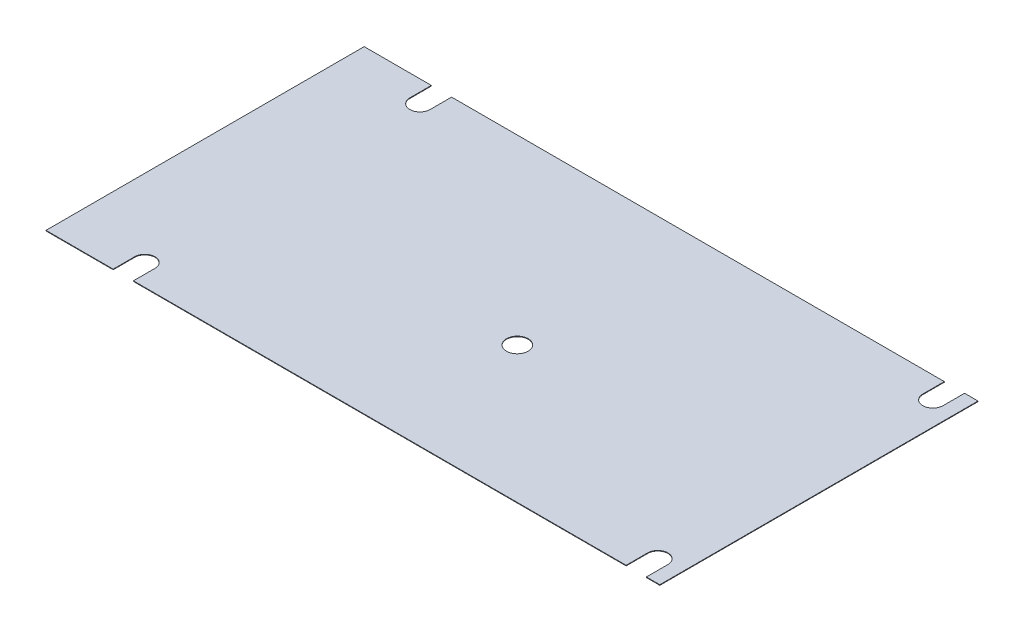
ISO-10303-21;
HEADER;
FILE_DESCRIPTION(('STEP AP214'),'2;1');
FILE_NAME('part.step','',(''),(''),'','','');
FILE_SCHEMA(('AUTOMOTIVE_DESIGN { 1 0 10303 214 1 1 1 1 }'));
ENDSEC;
DATA;
#1=APPLICATION_CONTEXT('core data for automotive mechanical design processes');
#2=APPLICATION_PROTOCOL_DEFINITION('international standard','automotive_design',2000,#1);
#3=PRODUCT_CONTEXT('',#1,'mechanical');
#4=PRODUCT('Part','Part','',(#3));
#5=PRODUCT_RELATED_PRODUCT_CATEGORY('part','',(#4));
#6=PRODUCT_DEFINITION_FORMATION('','',#4);
#7=PRODUCT_DEFINITION_CONTEXT('part definition',#1,'design');
#8=PRODUCT_DEFINITION('design','',#6,#7);
#9=PRODUCT_DEFINITION_SHAPE('','',#8);
#10=(LENGTH_UNIT() NAMED_UNIT(*) SI_UNIT(.MILLI.,.METRE.));
#11=(NAMED_UNIT(*) PLANE_ANGLE_UNIT() SI_UNIT($,.RADIAN.));
#12=(NAMED_UNIT(*) SI_UNIT($,.STERADIAN.) SOLID_ANGLE_UNIT());
#13=UNCERTAINTY_MEASURE_WITH_UNIT(LENGTH_MEASURE(1.E-05),#10,'distance_accuracy_value','');
#14=(GEOMETRIC_REPRESENTATION_CONTEXT(3) GLOBAL_UNCERTAINTY_ASSIGNED_CONTEXT((#13)) GLOBAL_UNIT_ASSIGNED_CONTEXT((#10,
#11,#12)) REPRESENTATION_CONTEXT('',''));
#15=CARTESIAN_POINT('',(0.,0.,0.));
#16=DIRECTION('',(0.,0.,1.));
#17=DIRECTION('',(1.,0.,0.));
#18=AXIS2_PLACEMENT_3D('',#15,#16,#17);
#19=CARTESIAN_POINT('',(-106.2,1.2,-55.05));
#20=DIRECTION('',(0.,0.,1.));
#21=DIRECTION('',(1.,0.,0.));
#22=AXIS2_PLACEMENT_3D('',#19,#20,#21);
#23=PLANE('',#22);
#24=DIRECTION('',(-1.,0.,0.));
#25=VECTOR('',#24,1.);
#26=CARTESIAN_POINT('',(-106.2,1.2,-55.05));
#27=LINE('',#26,#25);
#28=CARTESIAN_POINT('',(94.5500000000001,1.2,-55.0500000000001));
#29=VERTEX_POINT('',#28);
#30=CARTESIAN_POINT('',(-75.9499999999999,1.2,-55.05));
#31=VERTEX_POINT('',#30);
#32=EDGE_CURVE('E294',#29,#31,#27,.T.);
#33=ORIENTED_EDGE('',*,*,#32,.F.);
#34=DIRECTION('',(0.,-1.,0.));
#35=VECTOR('',#34,1.);
#36=CARTESIAN_POINT('',(94.5500000000001,1.2,-55.0500000000001));
#37=LINE('',#36,#35);
#38=CARTESIAN_POINT('',(94.5500000000001,1.,-55.0500000000001));
#39=VERTEX_POINT('',#38);
#40=EDGE_CURVE('E322',#29,#39,#37,.T.);
#41=ORIENTED_EDGE('',*,*,#40,.T.);
#42=DIRECTION('',(-1.,0.,0.));
#43=VECTOR('',#42,1.);
#44=CARTESIAN_POINT('',(-106.2,1.,-55.05));
#45=LINE('',#44,#43);
#46=CARTESIAN_POINT('',(-75.9499999999999,1.,-55.05));
#47=VERTEX_POINT('',#46);
#48=EDGE_CURVE('E275',#39,#47,#45,.T.);
#49=ORIENTED_EDGE('',*,*,#48,.T.);
#50=DIRECTION('',(0.,1.,0.));
#51=VECTOR('',#50,1.);
#52=CARTESIAN_POINT('',(-75.9499999999999,1.2,-55.05));
#53=LINE('',#52,#51);
#54=EDGE_CURVE('E180',#47,#31,#53,.T.);
#55=ORIENTED_EDGE('',*,*,#54,.T.);
#56=EDGE_LOOP('',(#33,#41,#49,#55));
#57=FACE_BOUND('',#56,.T.);
#58=ADVANCED_FACE('F38',(#57),#23,.F.);
#59=CARTESIAN_POINT('',(-82.9499999999999,1.2,-55.05));
#60=VERTEX_POINT('',#59);
#61=CARTESIAN_POINT('',(-106.2,1.2,-55.05));
#62=VERTEX_POINT('',#61);
#63=EDGE_CURVE('E251',#60,#62,#27,.T.);
#64=ORIENTED_EDGE('',*,*,#63,.F.);
#65=DIRECTION('',(0.,-1.,0.));
#66=VECTOR('',#65,1.);
#67=CARTESIAN_POINT('',(-82.9499999999999,1.2,-55.05));
#68=LINE('',#67,#66);
#69=CARTESIAN_POINT('',(-82.9499999999999,1.,-55.0500000000001));
#70=VERTEX_POINT('',#69);
#71=EDGE_CURVE('E274',#60,#70,#68,.T.);
#72=ORIENTED_EDGE('',*,*,#71,.T.);
#73=CARTESIAN_POINT('',(-106.2,1.,-55.05));
#74=VERTEX_POINT('',#73);
#75=EDGE_CURVE('E273',#70,#74,#45,.T.);
#76=ORIENTED_EDGE('',*,*,#75,.T.);
#77=DIRECTION('',(0.,-1.,0.));
#78=VECTOR('',#77,1.);
#79=CARTESIAN_POINT('',(-106.2,1.2,-55.05));
#80=LINE('',#79,#78);
#81=EDGE_CURVE('E186',#62,#74,#80,.T.);
#82=ORIENTED_EDGE('',*,*,#81,.F.);
#83=EDGE_LOOP('',(#64,#72,#76,#82));
#84=FACE_BOUND('',#83,.T.);
#85=ADVANCED_FACE('F271',(#84),#23,.F.);
#86=CARTESIAN_POINT('',(106.2,1.2,55.05));
#87=DIRECTION('',(0.,0.,-1.));
#88=DIRECTION('',(-1.,0.,0.));
#89=AXIS2_PLACEMENT_3D('',#86,#87,#88);
#90=PLANE('',#89);
#91=DIRECTION('',(1.,0.,0.));
#92=VECTOR('',#91,1.);
#93=CARTESIAN_POINT('',(106.2,1.2,55.05));
#94=LINE('',#93,#92);
#95=CARTESIAN_POINT('',(-75.9499999999999,1.2,55.05));
#96=VERTEX_POINT('',#95);
#97=CARTESIAN_POINT('',(94.5500000000001,1.2,55.05));
#98=VERTEX_POINT('',#97);
#99=EDGE_CURVE('E288',#96,#98,#94,.T.);
#100=ORIENTED_EDGE('',*,*,#99,.F.);
#101=DIRECTION('',(0.,-1.,0.));
#102=VECTOR('',#101,1.);
#103=CARTESIAN_POINT('',(-75.9499999999999,1.2,55.05));
#104=LINE('',#103,#102);
#105=CARTESIAN_POINT('',(-75.9499999999999,1.,55.05));
#106=VERTEX_POINT('',#105);
#107=EDGE_CURVE('E297',#96,#106,#104,.T.);
#108=ORIENTED_EDGE('',*,*,#107,.T.);
#109=DIRECTION('',(1.,0.,0.));
#110=VECTOR('',#109,1.);
#111=CARTESIAN_POINT('',(106.2,1.,55.05));
#112=LINE('',#111,#110);
#113=CARTESIAN_POINT('',(94.5500000000001,1.,55.05));
#114=VERTEX_POINT('',#113);
#115=EDGE_CURVE('E238',#106,#114,#112,.T.);
#116=ORIENTED_EDGE('',*,*,#115,.T.);
#117=DIRECTION('',(0.,1.,0.));
#118=VECTOR('',#117,1.);
#119=CARTESIAN_POINT('',(94.5500000000001,1.2,55.05));
#120=LINE('',#119,#118);
#121=EDGE_CURVE('E53',#114,#98,#120,.T.);
#122=ORIENTED_EDGE('',*,*,#121,.T.);
#123=EDGE_LOOP('',(#100,#108,#116,#122));
#124=FACE_BOUND('',#123,.T.);
#125=ADVANCED_FACE('F407',(#124),#90,.F.);
#126=CARTESIAN_POINT('',(101.55,1.2,55.05));
#127=VERTEX_POINT('',#126);
#128=CARTESIAN_POINT('',(106.2,1.2,55.05));
#129=VERTEX_POINT('',#128);
#130=EDGE_CURVE('E289',#127,#129,#94,.T.);
#131=ORIENTED_EDGE('',*,*,#130,.F.);
#132=DIRECTION('',(0.,-1.,0.));
#133=VECTOR('',#132,1.);
#134=CARTESIAN_POINT('',(101.55,1.2,55.05));
#135=LINE('',#134,#133);
#136=CARTESIAN_POINT('',(101.55,1.,55.05));
#137=VERTEX_POINT('',#136);
#138=EDGE_CURVE('E309',#127,#137,#135,.T.);
#139=ORIENTED_EDGE('',*,*,#138,.T.);
#140=CARTESIAN_POINT('',(106.2,1.,55.05));
#141=VERTEX_POINT('',#140);
#142=EDGE_CURVE('E242',#137,#141,#112,.T.);
#143=ORIENTED_EDGE('',*,*,#142,.T.);
#144=DIRECTION('',(0.,-1.,0.));
#145=VECTOR('',#144,1.);
#146=CARTESIAN_POINT('',(106.2,1.2,55.05));
#147=LINE('',#146,#145);
#148=EDGE_CURVE('E255',#129,#141,#147,.T.);
#149=ORIENTED_EDGE('',*,*,#148,.F.);
#150=EDGE_LOOP('',(#131,#139,#143,#149));
#151=FACE_BOUND('',#150,.T.);
#152=ADVANCED_FACE('F399',(#151),#90,.F.);
#153=CARTESIAN_POINT('',(106.2,1.,-55.0500000000001));
#154=VERTEX_POINT('',#153);
#155=CARTESIAN_POINT('',(101.55,1.,-55.0500000000001));
#156=VERTEX_POINT('',#155);
#157=EDGE_CURVE('E277',#154,#156,#45,.T.);
#158=ORIENTED_EDGE('',*,*,#157,.T.);
#159=DIRECTION('',(0.,1.,0.));
#160=VECTOR('',#159,1.);
#161=CARTESIAN_POINT('',(101.55,1.2,-55.0500000000001));
#162=LINE('',#161,#160);
#163=CARTESIAN_POINT('',(101.55,1.2,-55.0500000000001));
#164=VERTEX_POINT('',#163);
#165=EDGE_CURVE('E328',#156,#164,#162,.T.);
#166=ORIENTED_EDGE('',*,*,#165,.T.);
#167=CARTESIAN_POINT('',(106.2,1.2,-55.0500000000001));
#168=VERTEX_POINT('',#167);
#169=EDGE_CURVE('E291',#168,#164,#27,.T.);
#170=ORIENTED_EDGE('',*,*,#169,.F.);
#171=DIRECTION('',(0.,-1.,0.));
#172=VECTOR('',#171,1.);
#173=CARTESIAN_POINT('',(106.2,1.2,-55.0500000000001));
#174=LINE('',#173,#172);
#175=EDGE_CURVE('E252',#168,#154,#174,.T.);
#176=ORIENTED_EDGE('',*,*,#175,.T.);
#177=EDGE_LOOP('',(#158,#166,#170,#176));
#178=FACE_BOUND('',#177,.T.);
#179=ADVANCED_FACE('F40',(#178),#23,.F.);
#180=CARTESIAN_POINT('',(-106.2,1.2,55.05));
#181=DIRECTION('',(1.,0.,0.));
#182=DIRECTION('',(0.,0.,-1.));
#183=AXIS2_PLACEMENT_3D('',#180,#181,#182);
#184=PLANE('',#183);
#185=DIRECTION('',(0.,0.,1.));
#186=VECTOR('',#185,1.);
#187=CARTESIAN_POINT('',(-106.2,1.,55.05));
#188=LINE('',#187,#186);
#189=CARTESIAN_POINT('',(-106.2,1.,55.05));
#190=VERTEX_POINT('',#189);
#191=EDGE_CURVE('E246',#74,#190,#188,.T.);
#192=ORIENTED_EDGE('',*,*,#191,.T.);
#193=DIRECTION('',(0.,-1.,0.));
#194=VECTOR('',#193,1.);
#195=CARTESIAN_POINT('',(-106.2,1.2,55.05));
#196=LINE('',#195,#194);
#197=CARTESIAN_POINT('',(-106.2,1.2,55.05));
#198=VERTEX_POINT('',#197);
#199=EDGE_CURVE('E259',#198,#190,#196,.T.);
#200=ORIENTED_EDGE('',*,*,#199,.F.);
#201=DIRECTION('',(0.,0.,1.));
#202=VECTOR('',#201,1.);
#203=CARTESIAN_POINT('',(-106.2,1.2,55.05));
#204=LINE('',#203,#202);
#205=EDGE_CURVE('E268',#62,#198,#204,.T.);
#206=ORIENTED_EDGE('',*,*,#205,.F.);
#207=ORIENTED_EDGE('',*,*,#81,.T.);
#208=EDGE_LOOP('',(#192,#200,#206,#207));
#209=FACE_BOUND('',#208,.T.);
#210=ADVANCED_FACE('F265',(#209),#184,.F.);
#211=CARTESIAN_POINT('',(-82.9499999999999,1.,55.05));
#212=VERTEX_POINT('',#211);
#213=EDGE_CURVE('E241',#190,#212,#112,.T.);
#214=ORIENTED_EDGE('',*,*,#213,.T.);
#215=DIRECTION('',(0.,1.,0.));
#216=VECTOR('',#215,1.);
#217=CARTESIAN_POINT('',(-82.9499999999999,1.2,55.05));
#218=LINE('',#217,#216);
#219=CARTESIAN_POINT('',(-82.9499999999999,1.2,55.05));
#220=VERTEX_POINT('',#219);
#221=EDGE_CURVE('E61',#212,#220,#218,.T.);
#222=ORIENTED_EDGE('',*,*,#221,.T.);
#223=EDGE_CURVE('E285',#198,#220,#94,.T.);
#224=ORIENTED_EDGE('',*,*,#223,.F.);
#225=ORIENTED_EDGE('',*,*,#199,.T.);
#226=EDGE_LOOP('',(#214,#222,#224,#225));
#227=FACE_BOUND('',#226,.T.);
#228=ADVANCED_FACE('F373',(#227),#90,.F.);
#229=CARTESIAN_POINT('',(106.2,1.2,-55.0500000000001));
#230=DIRECTION('',(-1.,0.,0.));
#231=DIRECTION('',(0.,0.,1.));
#232=AXIS2_PLACEMENT_3D('',#229,#230,#231);
#233=PLANE('',#232);
#234=DIRECTION('',(0.,0.,-1.));
#235=VECTOR('',#234,1.);
#236=CARTESIAN_POINT('',(106.2,1.,-55.0500000000001));
#237=LINE('',#236,#235);
#238=EDGE_CURVE('E245',#141,#154,#237,.T.);
#239=ORIENTED_EDGE('',*,*,#238,.T.);
#240=ORIENTED_EDGE('',*,*,#175,.F.);
#241=DIRECTION('',(0.,0.,-1.));
#242=VECTOR('',#241,1.);
#243=CARTESIAN_POINT('',(106.2,1.2,-55.0500000000001));
#244=LINE('',#243,#242);
#245=EDGE_CURVE('E256',#129,#168,#244,.T.);
#246=ORIENTED_EDGE('',*,*,#245,.F.);
#247=ORIENTED_EDGE('',*,*,#148,.T.);
#248=EDGE_LOOP('',(#239,#240,#246,#247));
#249=FACE_BOUND('',#248,.T.);
#250=ADVANCED_FACE('F368',(#249),#233,.F.);
#251=CARTESIAN_POINT('',(0.,1.2,0.));
#252=DIRECTION('',(0.,-1.,0.));
#253=DIRECTION('',(0.,0.,-1.));
#254=AXIS2_PLACEMENT_3D('',#251,#252,#253);
#255=PLANE('',#254);
#256=CARTESIAN_POINT('',(9.70000000000008,1.2,7.85000000000002));
#257=DIRECTION('',(0.,-1.,0.));
#258=DIRECTION('',(0.,0.,-1.));
#259=AXIS2_PLACEMENT_3D('',#256,#257,#258);
#260=CIRCLE('',#259,3.75);
#261=CARTESIAN_POINT('',(9.70000000000008,1.2,4.10000000000002));
#262=VERTEX_POINT('',#261);
#263=EDGE_CURVE('E339',#262,#262,#260,.T.);
#264=ORIENTED_EDGE('',*,*,#263,.T.);
#265=EDGE_LOOP('',(#264));
#266=FACE_BOUND('',#265,.T.);
#267=CARTESIAN_POINT('',(-79.4499999999999,1.2,47.6));
#268=DIRECTION('',(0.,-1.,0.));
#269=DIRECTION('',(0.,0.,-1.));
#270=AXIS2_PLACEMENT_3D('',#267,#268,#269);
#271=CIRCLE('',#270,3.5);
#272=CARTESIAN_POINT('',(-82.9499999999999,1.2,47.6));
#273=VERTEX_POINT('',#272);
#274=CARTESIAN_POINT('',(-75.9499999999999,1.2,47.6));
#275=VERTEX_POINT('',#274);
#276=EDGE_CURVE('E276',#273,#275,#271,.T.);
#277=ORIENTED_EDGE('',*,*,#276,.T.);
#278=DIRECTION('',(0.,0.,1.));
#279=VECTOR('',#278,1.);
#280=CARTESIAN_POINT('',(-75.9499999999999,1.2,0.));
#281=LINE('',#280,#279);
#282=EDGE_CURVE('E233',#275,#96,#281,.T.);
#283=ORIENTED_EDGE('',*,*,#282,.T.);
#284=ORIENTED_EDGE('',*,*,#99,.T.);
#285=DIRECTION('',(0.,0.,-1.));
#286=VECTOR('',#285,1.);
#287=CARTESIAN_POINT('',(94.5500000000001,1.2,0.));
#288=LINE('',#287,#286);
#289=CARTESIAN_POINT('',(94.5500000000001,1.2,47.6));
#290=VERTEX_POINT('',#289);
#291=EDGE_CURVE('E312',#98,#290,#288,.T.);
#292=ORIENTED_EDGE('',*,*,#291,.T.);
#293=CARTESIAN_POINT('',(98.0500000000001,1.2,47.6));
#294=DIRECTION('',(0.,-1.,0.));
#295=DIRECTION('',(0.,0.,-1.));
#296=AXIS2_PLACEMENT_3D('',#293,#294,#295);
#297=CIRCLE('',#296,3.5);
#298=CARTESIAN_POINT('',(101.55,1.2,47.6));
#299=VERTEX_POINT('',#298);
#300=EDGE_CURVE('E303',#290,#299,#297,.T.);
#301=ORIENTED_EDGE('',*,*,#300,.T.);
#302=DIRECTION('',(0.,0.,1.));
#303=VECTOR('',#302,1.);
#304=CARTESIAN_POINT('',(101.55,1.2,0.));
#305=LINE('',#304,#303);
#306=EDGE_CURVE('E306',#299,#127,#305,.T.);
#307=ORIENTED_EDGE('',*,*,#306,.T.);
#308=ORIENTED_EDGE('',*,*,#130,.T.);
#309=ORIENTED_EDGE('',*,*,#245,.T.);
#310=ORIENTED_EDGE('',*,*,#169,.T.);
#311=DIRECTION('',(0.,0.,1.));
#312=VECTOR('',#311,1.);
#313=CARTESIAN_POINT('',(101.55,1.2,0.));
#314=LINE('',#313,#312);
#315=CARTESIAN_POINT('',(101.55,1.2,-47.6));
#316=VERTEX_POINT('',#315);
#317=EDGE_CURVE('E325',#164,#316,#314,.T.);
#318=ORIENTED_EDGE('',*,*,#317,.T.);
#319=CARTESIAN_POINT('',(98.0500000000001,1.2,-47.6));
#320=DIRECTION('',(0.,-1.,0.));
#321=DIRECTION('',(0.,0.,-1.));
#322=AXIS2_PLACEMENT_3D('',#319,#320,#321);
#323=CIRCLE('',#322,3.5);
#324=CARTESIAN_POINT('',(94.5500000000001,1.2,-47.6));
#325=VERTEX_POINT('',#324);
#326=EDGE_CURVE('E316',#316,#325,#323,.T.);
#327=ORIENTED_EDGE('',*,*,#326,.T.);
#328=DIRECTION('',(0.,0.,-1.));
#329=VECTOR('',#328,1.);
#330=CARTESIAN_POINT('',(94.5500000000001,1.2,0.));
#331=LINE('',#330,#329);
#332=EDGE_CURVE('E319',#325,#29,#331,.T.);
#333=ORIENTED_EDGE('',*,*,#332,.T.);
#334=ORIENTED_EDGE('',*,*,#32,.T.);
#335=DIRECTION('',(0.,0.,1.));
#336=VECTOR('',#335,1.);
#337=CARTESIAN_POINT('',(-75.9499999999999,1.2,0.));
#338=LINE('',#337,#336);
#339=CARTESIAN_POINT('',(-75.9499999999999,1.2,-47.6));
#340=VERTEX_POINT('',#339);
#341=EDGE_CURVE('E335',#31,#340,#338,.T.);
#342=ORIENTED_EDGE('',*,*,#341,.T.);
#343=CARTESIAN_POINT('',(-79.4499999999999,1.2,-47.6));
#344=DIRECTION('',(0.,-1.,0.));
#345=DIRECTION('',(0.,0.,-1.));
#346=AXIS2_PLACEMENT_3D('',#343,#344,#345);
#347=CIRCLE('',#346,3.5);
#348=CARTESIAN_POINT('',(-82.9499999999999,1.2,-47.6));
#349=VERTEX_POINT('',#348);
#350=EDGE_CURVE('E193',#340,#349,#347,.T.);
#351=ORIENTED_EDGE('',*,*,#350,.T.);
#352=DIRECTION('',(0.,0.,-1.));
#353=VECTOR('',#352,1.);
#354=CARTESIAN_POINT('',(-82.9499999999999,1.2,0.));
#355=LINE('',#354,#353);
#356=EDGE_CURVE('E331',#349,#60,#355,.T.);
#357=ORIENTED_EDGE('',*,*,#356,.T.);
#358=ORIENTED_EDGE('',*,*,#63,.T.);
#359=ORIENTED_EDGE('',*,*,#205,.T.);
#360=ORIENTED_EDGE('',*,*,#223,.T.);
#361=DIRECTION('',(0.,0.,-1.));
#362=VECTOR('',#361,1.);
#363=CARTESIAN_POINT('',(-82.9499999999999,1.2,0.));
#364=LINE('',#363,#362);
#365=EDGE_CURVE('E299',#220,#273,#364,.T.);
#366=ORIENTED_EDGE('',*,*,#365,.T.);
#367=EDGE_LOOP('',(#277,#283,#284,#292,#301,#307,#308,#309,#310,#318,#327,#333,#334,#342,#351,
#357,#358,#359,#360,#366));
#368=FACE_BOUND('',#367,.T.);
#369=ADVANCED_FACE('F365',(#266,#368),#255,.F.);
#370=CARTESIAN_POINT('',(0.,1.,0.));
#371=DIRECTION('',(0.,-1.,0.));
#372=DIRECTION('',(0.,0.,-1.));
#373=AXIS2_PLACEMENT_3D('',#370,#371,#372);
#374=PLANE('',#373);
#375=CARTESIAN_POINT('',(9.70000000000008,1.,7.85000000000002));
#376=DIRECTION('',(0.,1.,0.));
#377=DIRECTION('',(0.,0.,1.));
#378=AXIS2_PLACEMENT_3D('',#375,#376,#377);
#379=CIRCLE('',#378,3.75);
#380=CARTESIAN_POINT('',(9.70000000000008,1.,11.6));
#381=VERTEX_POINT('',#380);
#382=EDGE_CURVE('E353',#381,#381,#379,.T.);
#383=ORIENTED_EDGE('',*,*,#382,.T.);
#384=EDGE_LOOP('',(#383));
#385=FACE_BOUND('',#384,.T.);
#386=DIRECTION('',(0.,0.,1.));
#387=VECTOR('',#386,1.);
#388=CARTESIAN_POINT('',(-75.9499999999999,1.,0.));
#389=LINE('',#388,#387);
#390=CARTESIAN_POINT('',(-75.9499999999999,1.,47.6));
#391=VERTEX_POINT('',#390);
#392=EDGE_CURVE('E11',#391,#106,#389,.T.);
#393=ORIENTED_EDGE('',*,*,#392,.F.);
#394=CARTESIAN_POINT('',(-79.4499999999999,1.,47.6));
#395=DIRECTION('',(0.,-1.,0.));
#396=DIRECTION('',(0.,0.,-1.));
#397=AXIS2_PLACEMENT_3D('',#394,#395,#396);
#398=CIRCLE('',#397,3.5);
#399=CARTESIAN_POINT('',(-82.9499999999999,1.,47.6));
#400=VERTEX_POINT('',#399);
#401=EDGE_CURVE('E46',#400,#391,#398,.T.);
#402=ORIENTED_EDGE('',*,*,#401,.F.);
#403=DIRECTION('',(0.,0.,-1.));
#404=VECTOR('',#403,1.);
#405=CARTESIAN_POINT('',(-82.9499999999999,1.,0.));
#406=LINE('',#405,#404);
#407=EDGE_CURVE('E218',#212,#400,#406,.T.);
#408=ORIENTED_EDGE('',*,*,#407,.F.);
#409=ORIENTED_EDGE('',*,*,#213,.F.);
#410=ORIENTED_EDGE('',*,*,#191,.F.);
#411=ORIENTED_EDGE('',*,*,#75,.F.);
#412=DIRECTION('',(0.,0.,-1.));
#413=VECTOR('',#412,1.);
#414=CARTESIAN_POINT('',(-82.9499999999999,1.,0.));
#415=LINE('',#414,#413);
#416=CARTESIAN_POINT('',(-82.9499999999999,1.,-47.6));
#417=VERTEX_POINT('',#416);
#418=EDGE_CURVE('E201',#417,#70,#415,.T.);
#419=ORIENTED_EDGE('',*,*,#418,.F.);
#420=CARTESIAN_POINT('',(-79.4499999999999,1.,-47.6));
#421=DIRECTION('',(0.,-1.,0.));
#422=DIRECTION('',(0.,0.,-1.));
#423=AXIS2_PLACEMENT_3D('',#420,#421,#422);
#424=CIRCLE('',#423,3.5);
#425=CARTESIAN_POINT('',(-75.9499999999999,1.,-47.6));
#426=VERTEX_POINT('',#425);
#427=EDGE_CURVE('E185',#426,#417,#424,.T.);
#428=ORIENTED_EDGE('',*,*,#427,.F.);
#429=DIRECTION('',(0.,0.,1.));
#430=VECTOR('',#429,1.);
#431=CARTESIAN_POINT('',(-75.9499999999999,1.,0.));
#432=LINE('',#431,#430);
#433=EDGE_CURVE('E174',#47,#426,#432,.T.);
#434=ORIENTED_EDGE('',*,*,#433,.F.);
#435=ORIENTED_EDGE('',*,*,#48,.F.);
#436=DIRECTION('',(0.,0.,-1.));
#437=VECTOR('',#436,1.);
#438=CARTESIAN_POINT('',(94.5500000000001,1.,0.));
#439=LINE('',#438,#437);
#440=CARTESIAN_POINT('',(94.5500000000001,1.,-47.6));
#441=VERTEX_POINT('',#440);
#442=EDGE_CURVE('E210',#441,#39,#439,.T.);
#443=ORIENTED_EDGE('',*,*,#442,.F.);
#444=CARTESIAN_POINT('',(98.0500000000001,1.,-47.6));
#445=DIRECTION('',(0.,-1.,0.));
#446=DIRECTION('',(0.,0.,-1.));
#447=AXIS2_PLACEMENT_3D('',#444,#445,#446);
#448=CIRCLE('',#447,3.5);
#449=CARTESIAN_POINT('',(101.55,1.,-47.6));
#450=VERTEX_POINT('',#449);
#451=EDGE_CURVE('E208',#450,#441,#448,.T.);
#452=ORIENTED_EDGE('',*,*,#451,.F.);
#453=DIRECTION('',(0.,0.,1.));
#454=VECTOR('',#453,1.);
#455=CARTESIAN_POINT('',(101.55,1.,0.));
#456=LINE('',#455,#454);
#457=EDGE_CURVE('E203',#156,#450,#456,.T.);
#458=ORIENTED_EDGE('',*,*,#457,.F.);
#459=ORIENTED_EDGE('',*,*,#157,.F.);
#460=ORIENTED_EDGE('',*,*,#238,.F.);
#461=ORIENTED_EDGE('',*,*,#142,.F.);
#462=DIRECTION('',(0.,0.,1.));
#463=VECTOR('',#462,1.);
#464=CARTESIAN_POINT('',(101.55,1.,0.));
#465=LINE('',#464,#463);
#466=CARTESIAN_POINT('',(101.55,1.,47.6));
#467=VERTEX_POINT('',#466);
#468=EDGE_CURVE('E216',#467,#137,#465,.T.);
#469=ORIENTED_EDGE('',*,*,#468,.F.);
#470=CARTESIAN_POINT('',(98.0500000000001,1.,47.6));
#471=DIRECTION('',(0.,-1.,0.));
#472=DIRECTION('',(0.,0.,-1.));
#473=AXIS2_PLACEMENT_3D('',#470,#471,#472);
#474=CIRCLE('',#473,3.5);
#475=CARTESIAN_POINT('',(94.5500000000001,1.,47.6));
#476=VERTEX_POINT('',#475);
#477=EDGE_CURVE('E214',#476,#467,#474,.T.);
#478=ORIENTED_EDGE('',*,*,#477,.F.);
#479=DIRECTION('',(0.,0.,-1.));
#480=VECTOR('',#479,1.);
#481=CARTESIAN_POINT('',(94.5500000000001,1.,0.));
#482=LINE('',#481,#480);
#483=EDGE_CURVE('E212',#114,#476,#482,.T.);
#484=ORIENTED_EDGE('',*,*,#483,.F.);
#485=ORIENTED_EDGE('',*,*,#115,.F.);
#486=EDGE_LOOP('',(#393,#402,#408,#409,#410,#411,#419,#428,#434,#435,#443,#452,#458,#459,#460,
#461,#469,#478,#484,#485));
#487=FACE_BOUND('',#486,.T.);
#488=ADVANCED_FACE('F199',(#385,#487),#374,.T.);
#489=CARTESIAN_POINT('',(-79.4499999999999,-5.6843418860808E-11,-47.6));
#490=DIRECTION('',(0.,1.,0.));
#491=DIRECTION('',(0.,0.,1.));
#492=AXIS2_PLACEMENT_3D('',#489,#490,#491);
#493=CYLINDRICAL_SURFACE('',#492,3.5);
#494=DIRECTION('',(0.,1.,0.));
#495=VECTOR('',#494,1.);
#496=CARTESIAN_POINT('',(-75.9499999999999,-5.6843418860808E-11,-47.6));
#497=LINE('',#496,#495);
#498=EDGE_CURVE('E177',#426,#340,#497,.T.);
#499=ORIENTED_EDGE('',*,*,#498,.F.);
#500=ORIENTED_EDGE('',*,*,#427,.T.);
#501=DIRECTION('',(0.,1.,0.));
#502=VECTOR('',#501,1.);
#503=CARTESIAN_POINT('',(-82.9499999999999,-5.6843418860808E-11,-47.6));
#504=LINE('',#503,#502);
#505=EDGE_CURVE('E194',#417,#349,#504,.T.);
#506=ORIENTED_EDGE('',*,*,#505,.T.);
#507=ORIENTED_EDGE('',*,*,#350,.F.);
#508=EDGE_LOOP('',(#499,#500,#506,#507));
#509=FACE_BOUND('',#508,.T.);
#510=ADVANCED_FACE('F189',(#509),#493,.F.);
#511=CARTESIAN_POINT('',(-82.9499999999999,-5.6843418860808E-11,-47.6));
#512=DIRECTION('',(-1.,0.,0.));
#513=DIRECTION('',(0.,0.,1.));
#514=AXIS2_PLACEMENT_3D('',#511,#512,#513);
#515=PLANE('',#514);
#516=ORIENTED_EDGE('',*,*,#505,.F.);
#517=ORIENTED_EDGE('',*,*,#418,.T.);
#518=ORIENTED_EDGE('',*,*,#71,.F.);
#519=ORIENTED_EDGE('',*,*,#356,.F.);
#520=EDGE_LOOP('',(#516,#517,#518,#519));
#521=FACE_BOUND('',#520,.T.);
#522=ADVANCED_FACE('F455',(#521),#515,.F.);
#523=CARTESIAN_POINT('',(-75.9499999999999,-5.6843418860808E-11,-47.6));
#524=DIRECTION('',(1.,0.,0.));
#525=DIRECTION('',(0.,0.,-1.));
#526=AXIS2_PLACEMENT_3D('',#523,#524,#525);
#527=PLANE('',#526);
#528=ORIENTED_EDGE('',*,*,#54,.F.);
#529=ORIENTED_EDGE('',*,*,#433,.T.);
#530=ORIENTED_EDGE('',*,*,#498,.T.);
#531=ORIENTED_EDGE('',*,*,#341,.F.);
#532=EDGE_LOOP('',(#528,#529,#530,#531));
#533=FACE_BOUND('',#532,.T.);
#534=ADVANCED_FACE('F176',(#533),#527,.F.);
#535=CARTESIAN_POINT('',(98.0500000000001,-5.6843418860808E-11,-47.6));
#536=DIRECTION('',(0.,1.,0.));
#537=DIRECTION('',(0.,0.,1.));
#538=AXIS2_PLACEMENT_3D('',#535,#536,#537);
#539=CYLINDRICAL_SURFACE('',#538,3.5);
#540=DIRECTION('',(0.,1.,0.));
#541=VECTOR('',#540,1.);
#542=CARTESIAN_POINT('',(101.55,-5.6843418860808E-11,-47.6));
#543=LINE('',#542,#541);
#544=EDGE_CURVE('E346',#450,#316,#543,.T.);
#545=ORIENTED_EDGE('',*,*,#544,.F.);
#546=ORIENTED_EDGE('',*,*,#451,.T.);
#547=DIRECTION('',(0.,1.,0.));
#548=VECTOR('',#547,1.);
#549=CARTESIAN_POINT('',(94.5500000000001,-5.6843418860808E-11,-47.6));
#550=LINE('',#549,#548);
#551=EDGE_CURVE('E195',#441,#325,#550,.T.);
#552=ORIENTED_EDGE('',*,*,#551,.T.);
#553=ORIENTED_EDGE('',*,*,#326,.F.);
#554=EDGE_LOOP('',(#545,#546,#552,#553));
#555=FACE_BOUND('',#554,.T.);
#556=ADVANCED_FACE('F386',(#555),#539,.F.);
#557=CARTESIAN_POINT('',(94.5500000000001,-5.6843418860808E-11,-47.6));
#558=DIRECTION('',(-1.,0.,0.));
#559=DIRECTION('',(0.,0.,1.));
#560=AXIS2_PLACEMENT_3D('',#557,#558,#559);
#561=PLANE('',#560);
#562=ORIENTED_EDGE('',*,*,#551,.F.);
#563=ORIENTED_EDGE('',*,*,#442,.T.);
#564=ORIENTED_EDGE('',*,*,#40,.F.);
#565=ORIENTED_EDGE('',*,*,#332,.F.);
#566=EDGE_LOOP('',(#562,#563,#564,#565));
#567=FACE_BOUND('',#566,.T.);
#568=ADVANCED_FACE('F383',(#567),#561,.F.);
#569=CARTESIAN_POINT('',(101.55,-5.6843418860808E-11,-47.6));
#570=DIRECTION('',(1.,0.,0.));
#571=DIRECTION('',(0.,0.,-1.));
#572=AXIS2_PLACEMENT_3D('',#569,#570,#571);
#573=PLANE('',#572);
#574=ORIENTED_EDGE('',*,*,#165,.F.);
#575=ORIENTED_EDGE('',*,*,#457,.T.);
#576=ORIENTED_EDGE('',*,*,#544,.T.);
#577=ORIENTED_EDGE('',*,*,#317,.F.);
#578=EDGE_LOOP('',(#574,#575,#576,#577));
#579=FACE_BOUND('',#578,.T.);
#580=ADVANCED_FACE('F389',(#579),#573,.F.);
#581=CARTESIAN_POINT('',(98.0500000000001,-5.6843418860808E-11,47.6));
#582=DIRECTION('',(0.,1.,0.));
#583=DIRECTION('',(0.,0.,1.));
#584=AXIS2_PLACEMENT_3D('',#581,#582,#583);
#585=CYLINDRICAL_SURFACE('',#584,3.5);
#586=DIRECTION('',(0.,1.,0.));
#587=VECTOR('',#586,1.);
#588=CARTESIAN_POINT('',(94.5500000000001,-5.6843418860808E-11,47.6));
#589=LINE('',#588,#587);
#590=EDGE_CURVE('E234',#476,#290,#589,.T.);
#591=ORIENTED_EDGE('',*,*,#590,.F.);
#592=ORIENTED_EDGE('',*,*,#477,.T.);
#593=DIRECTION('',(0.,1.,0.));
#594=VECTOR('',#593,1.);
#595=CARTESIAN_POINT('',(101.55,-5.6843418860808E-11,47.6));
#596=LINE('',#595,#594);
#597=EDGE_CURVE('E343',#467,#299,#596,.T.);
#598=ORIENTED_EDGE('',*,*,#597,.T.);
#599=ORIENTED_EDGE('',*,*,#300,.F.);
#600=EDGE_LOOP('',(#591,#592,#598,#599));
#601=FACE_BOUND('',#600,.T.);
#602=ADVANCED_FACE('F405',(#601),#585,.F.);
#603=CARTESIAN_POINT('',(101.55,-5.6843418860808E-11,47.6));
#604=DIRECTION('',(1.,0.,0.));
#605=DIRECTION('',(0.,0.,-1.));
#606=AXIS2_PLACEMENT_3D('',#603,#604,#605);
#607=PLANE('',#606);
#608=ORIENTED_EDGE('',*,*,#597,.F.);
#609=ORIENTED_EDGE('',*,*,#468,.T.);
#610=ORIENTED_EDGE('',*,*,#138,.F.);
#611=ORIENTED_EDGE('',*,*,#306,.F.);
#612=EDGE_LOOP('',(#608,#609,#610,#611));
#613=FACE_BOUND('',#612,.T.);
#614=ADVANCED_FACE('F402',(#613),#607,.F.);
#615=CARTESIAN_POINT('',(94.5500000000001,-5.6843418860808E-11,47.6));
#616=DIRECTION('',(-1.,0.,0.));
#617=DIRECTION('',(0.,0.,1.));
#618=AXIS2_PLACEMENT_3D('',#615,#616,#617);
#619=PLANE('',#618);
#620=ORIENTED_EDGE('',*,*,#121,.F.);
#621=ORIENTED_EDGE('',*,*,#483,.T.);
#622=ORIENTED_EDGE('',*,*,#590,.T.);
#623=ORIENTED_EDGE('',*,*,#291,.F.);
#624=EDGE_LOOP('',(#620,#621,#622,#623));
#625=FACE_BOUND('',#624,.T.);
#626=ADVANCED_FACE('F406',(#625),#619,.F.);
#627=CARTESIAN_POINT('',(-79.4499999999999,-5.6843418860808E-11,47.6));
#628=DIRECTION('',(0.,1.,0.));
#629=DIRECTION('',(0.,0.,1.));
#630=AXIS2_PLACEMENT_3D('',#627,#628,#629);
#631=CYLINDRICAL_SURFACE('',#630,3.5);
#632=DIRECTION('',(0.,1.,0.));
#633=VECTOR('',#632,1.);
#634=CARTESIAN_POINT('',(-82.9499999999999,-5.6843418860808E-11,47.6));
#635=LINE('',#634,#633);
#636=EDGE_CURVE('E228',#400,#273,#635,.T.);
#637=ORIENTED_EDGE('',*,*,#636,.F.);
#638=ORIENTED_EDGE('',*,*,#401,.T.);
#639=DIRECTION('',(0.,1.,0.));
#640=VECTOR('',#639,1.);
#641=CARTESIAN_POINT('',(-75.9499999999999,-5.6843418860808E-11,47.6));
#642=LINE('',#641,#640);
#643=EDGE_CURVE('E225',#391,#275,#642,.T.);
#644=ORIENTED_EDGE('',*,*,#643,.T.);
#645=ORIENTED_EDGE('',*,*,#276,.F.);
#646=EDGE_LOOP('',(#637,#638,#644,#645));
#647=FACE_BOUND('',#646,.T.);
#648=ADVANCED_FACE('F224',(#647),#631,.F.);
#649=CARTESIAN_POINT('',(-75.9499999999999,-5.6843418860808E-11,47.6));
#650=DIRECTION('',(1.,0.,0.));
#651=DIRECTION('',(0.,0.,-1.));
#652=AXIS2_PLACEMENT_3D('',#649,#650,#651);
#653=PLANE('',#652);
#654=ORIENTED_EDGE('',*,*,#643,.F.);
#655=ORIENTED_EDGE('',*,*,#392,.T.);
#656=ORIENTED_EDGE('',*,*,#107,.F.);
#657=ORIENTED_EDGE('',*,*,#282,.F.);
#658=EDGE_LOOP('',(#654,#655,#656,#657));
#659=FACE_BOUND('',#658,.T.);
#660=ADVANCED_FACE('F230',(#659),#653,.F.);
#661=CARTESIAN_POINT('',(-82.9499999999999,-5.6843418860808E-11,47.6));
#662=DIRECTION('',(-1.,0.,0.));
#663=DIRECTION('',(0.,0.,1.));
#664=AXIS2_PLACEMENT_3D('',#661,#662,#663);
#665=PLANE('',#664);
#666=ORIENTED_EDGE('',*,*,#221,.F.);
#667=ORIENTED_EDGE('',*,*,#407,.T.);
#668=ORIENTED_EDGE('',*,*,#636,.T.);
#669=ORIENTED_EDGE('',*,*,#365,.F.);
#670=EDGE_LOOP('',(#666,#667,#668,#669));
#671=FACE_BOUND('',#670,.T.);
#672=ADVANCED_FACE('F361',(#671),#665,.F.);
#673=CARTESIAN_POINT('',(9.70000000000008,1.,7.85000000000002));
#674=DIRECTION('',(0.,1.,0.));
#675=DIRECTION('',(0.,0.,1.));
#676=AXIS2_PLACEMENT_3D('',#673,#674,#675);
#677=CYLINDRICAL_SURFACE('',#676,3.75);
#678=ORIENTED_EDGE('',*,*,#382,.F.);
#679=EDGE_LOOP('',(#678));
#680=FACE_BOUND('',#679,.T.);
#681=ORIENTED_EDGE('',*,*,#263,.F.);
#682=EDGE_LOOP('',(#681));
#683=FACE_BOUND('',#682,.T.);
#684=ADVANCED_FACE('F358',(#680,#683),#677,.F.);
#685=CLOSED_SHELL('',(#58,#85,#125,#152,#179,#210,#228,#250,#369,#488,#510,#522,#534,#556,#568,
#580,#602,#614,#626,#648,#660,#672,#684));
#686=MANIFOLD_SOLID_BREP('B2',#685);
#687=ADVANCED_BREP_SHAPE_REPRESENTATION('',(#18,#686),#14);
#688=SHAPE_DEFINITION_REPRESENTATION(#9,#687);
ENDSEC;
END-ISO-10303-21;
